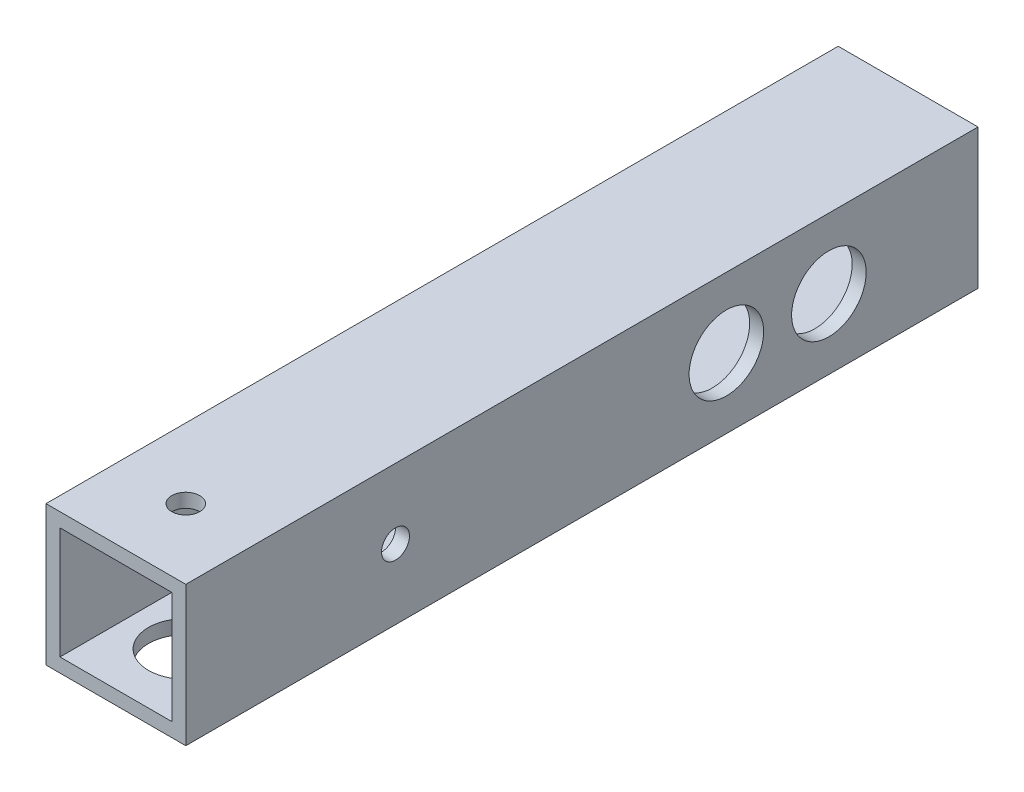
ISO-10303-21;
HEADER;
FILE_DESCRIPTION(('STEP AP214'),'2;1');
FILE_NAME('part.step','',(''),(''),'','','');
FILE_SCHEMA(('AUTOMOTIVE_DESIGN { 1 0 10303 214 1 1 1 1 }'));
ENDSEC;
DATA;
#1=APPLICATION_CONTEXT('core data for automotive mechanical design processes');
#2=APPLICATION_PROTOCOL_DEFINITION('international standard','automotive_design',2000,#1);
#3=PRODUCT_CONTEXT('',#1,'mechanical');
#4=PRODUCT('Part','Part','',(#3));
#5=PRODUCT_RELATED_PRODUCT_CATEGORY('part','',(#4));
#6=PRODUCT_DEFINITION_FORMATION('','',#4);
#7=PRODUCT_DEFINITION_CONTEXT('part definition',#1,'design');
#8=PRODUCT_DEFINITION('design','',#6,#7);
#9=PRODUCT_DEFINITION_SHAPE('','',#8);
#10=(LENGTH_UNIT() NAMED_UNIT(*) SI_UNIT(.MILLI.,.METRE.));
#11=(NAMED_UNIT(*) PLANE_ANGLE_UNIT() SI_UNIT($,.RADIAN.));
#12=(NAMED_UNIT(*) SI_UNIT($,.STERADIAN.) SOLID_ANGLE_UNIT());
#13=UNCERTAINTY_MEASURE_WITH_UNIT(LENGTH_MEASURE(1.E-05),#10,'distance_accuracy_value','');
#14=(GEOMETRIC_REPRESENTATION_CONTEXT(3) GLOBAL_UNCERTAINTY_ASSIGNED_CONTEXT((#13)) GLOBAL_UNIT_ASSIGNED_CONTEXT((#10,
#11,#12)) REPRESENTATION_CONTEXT('',''));
#15=CARTESIAN_POINT('',(0.,0.,0.));
#16=DIRECTION('',(0.,0.,1.));
#17=DIRECTION('',(1.,0.,0.));
#18=AXIS2_PLACEMENT_3D('',#15,#16,#17);
#19=CARTESIAN_POINT('',(0.,0.,85.));
#20=DIRECTION('',(0.,0.,1.));
#21=DIRECTION('',(1.,0.,0.));
#22=AXIS2_PLACEMENT_3D('',#19,#20,#21);
#23=PLANE('',#22);
#24=DIRECTION('',(0.,-1.,0.));
#25=VECTOR('',#24,1.);
#26=CARTESIAN_POINT('',(-7.01008414074451,7.73262608579252,85.));
#27=LINE('',#26,#25);
#28=CARTESIAN_POINT('',(-7.01008414074451,7.73262608579252,85.));
#29=VERTEX_POINT('',#28);
#30=CARTESIAN_POINT('',(-7.01008414074451,-7.26737391420748,85.));
#31=VERTEX_POINT('',#30);
#32=EDGE_CURVE('E137',#29,#31,#27,.T.);
#33=ORIENTED_EDGE('',*,*,#32,.T.);
#34=DIRECTION('',(1.,0.,0.));
#35=VECTOR('',#34,1.);
#36=CARTESIAN_POINT('',(-7.01008414074451,-7.26737391420748,85.));
#37=LINE('',#36,#35);
#38=CARTESIAN_POINT('',(7.98991585925548,-7.26737391420748,85.));
#39=VERTEX_POINT('',#38);
#40=EDGE_CURVE('E140',#31,#39,#37,.T.);
#41=ORIENTED_EDGE('',*,*,#40,.T.);
#42=DIRECTION('',(0.,1.,0.));
#43=VECTOR('',#42,1.);
#44=CARTESIAN_POINT('',(7.98991585925549,7.73262608579252,85.));
#45=LINE('',#44,#43);
#46=CARTESIAN_POINT('',(7.98991585925549,7.73262608579252,85.));
#47=VERTEX_POINT('',#46);
#48=EDGE_CURVE('E143',#39,#47,#45,.T.);
#49=ORIENTED_EDGE('',*,*,#48,.T.);
#50=DIRECTION('',(-1.,0.,0.));
#51=VECTOR('',#50,1.);
#52=CARTESIAN_POINT('',(-7.01008414074451,7.73262608579252,85.));
#53=LINE('',#52,#51);
#54=EDGE_CURVE('E145',#47,#29,#53,.T.);
#55=ORIENTED_EDGE('',*,*,#54,.T.);
#56=EDGE_LOOP('',(#33,#41,#49,#55));
#57=FACE_BOUND('',#56,.T.);
#58=DIRECTION('',(1.,0.,0.));
#59=VECTOR('',#58,1.);
#60=CARTESIAN_POINT('',(-5.51008414074451,-5.76737391420748,85.));
#61=LINE('',#60,#59);
#62=CARTESIAN_POINT('',(-5.51008414074451,-5.76737391420748,85.));
#63=VERTEX_POINT('',#62);
#64=CARTESIAN_POINT('',(6.48991585925549,-5.76737391420748,85.));
#65=VERTEX_POINT('',#64);
#66=EDGE_CURVE('E107',#63,#65,#61,.T.);
#67=ORIENTED_EDGE('',*,*,#66,.F.);
#68=DIRECTION('',(0.,-1.,0.));
#69=VECTOR('',#68,1.);
#70=CARTESIAN_POINT('',(-5.51008414074451,6.23262608579252,85.));
#71=LINE('',#70,#69);
#72=CARTESIAN_POINT('',(-5.51008414074451,6.23262608579252,85.));
#73=VERTEX_POINT('',#72);
#74=EDGE_CURVE('E99',#73,#63,#71,.T.);
#75=ORIENTED_EDGE('',*,*,#74,.F.);
#76=DIRECTION('',(-1.,0.,0.));
#77=VECTOR('',#76,1.);
#78=CARTESIAN_POINT('',(-5.51008414074451,6.23262608579252,85.));
#79=LINE('',#78,#77);
#80=CARTESIAN_POINT('',(6.48991585925549,6.23262608579252,85.));
#81=VERTEX_POINT('',#80);
#82=EDGE_CURVE('E121',#81,#73,#79,.T.);
#83=ORIENTED_EDGE('',*,*,#82,.F.);
#84=DIRECTION('',(0.,1.,0.));
#85=VECTOR('',#84,1.);
#86=CARTESIAN_POINT('',(6.48991585925549,6.23262608579252,85.));
#87=LINE('',#86,#85);
#88=EDGE_CURVE('E119',#65,#81,#87,.T.);
#89=ORIENTED_EDGE('',*,*,#88,.F.);
#90=EDGE_LOOP('',(#67,#75,#83,#89));
#91=FACE_BOUND('',#90,.T.);
#92=ADVANCED_FACE('F32',(#57,#91),#23,.T.);
#93=CARTESIAN_POINT('',(0.,0.,0.));
#94=DIRECTION('',(0.,0.,1.));
#95=DIRECTION('',(1.,0.,0.));
#96=AXIS2_PLACEMENT_3D('',#93,#94,#95);
#97=PLANE('',#96);
#98=DIRECTION('',(0.,-1.,0.));
#99=VECTOR('',#98,1.);
#100=CARTESIAN_POINT('',(-7.01008414074451,7.73262608579252,0.));
#101=LINE('',#100,#99);
#102=CARTESIAN_POINT('',(-7.01008414074451,7.73262608579252,0.));
#103=VERTEX_POINT('',#102);
#104=CARTESIAN_POINT('',(-7.01008414074451,-7.26737391420748,0.));
#105=VERTEX_POINT('',#104);
#106=EDGE_CURVE('E115',#103,#105,#101,.T.);
#107=ORIENTED_EDGE('',*,*,#106,.F.);
#108=DIRECTION('',(-1.,0.,0.));
#109=VECTOR('',#108,1.);
#110=CARTESIAN_POINT('',(-7.01008414074451,7.73262608579252,0.));
#111=LINE('',#110,#109);
#112=CARTESIAN_POINT('',(7.98991585925549,7.73262608579252,0.));
#113=VERTEX_POINT('',#112);
#114=EDGE_CURVE('E141',#113,#103,#111,.T.);
#115=ORIENTED_EDGE('',*,*,#114,.F.);
#116=DIRECTION('',(0.,1.,0.));
#117=VECTOR('',#116,1.);
#118=CARTESIAN_POINT('',(7.98991585925549,7.73262608579252,0.));
#119=LINE('',#118,#117);
#120=CARTESIAN_POINT('',(7.98991585925548,-7.26737391420748,0.));
#121=VERTEX_POINT('',#120);
#122=EDGE_CURVE('E152',#121,#113,#119,.T.);
#123=ORIENTED_EDGE('',*,*,#122,.F.);
#124=DIRECTION('',(1.,0.,0.));
#125=VECTOR('',#124,1.);
#126=CARTESIAN_POINT('',(-7.01008414074451,-7.26737391420748,0.));
#127=LINE('',#126,#125);
#128=EDGE_CURVE('E150',#105,#121,#127,.T.);
#129=ORIENTED_EDGE('',*,*,#128,.F.);
#130=EDGE_LOOP('',(#107,#115,#123,#129));
#131=FACE_BOUND('',#130,.T.);
#132=DIRECTION('',(0.,-1.,0.));
#133=VECTOR('',#132,1.);
#134=CARTESIAN_POINT('',(-5.51008414074451,6.23262608579252,0.));
#135=LINE('',#134,#133);
#136=CARTESIAN_POINT('',(-5.51008414074451,6.23262608579252,0.));
#137=VERTEX_POINT('',#136);
#138=CARTESIAN_POINT('',(-5.51008414074451,-5.76737391420748,0.));
#139=VERTEX_POINT('',#138);
#140=EDGE_CURVE('E57',#137,#139,#135,.T.);
#141=ORIENTED_EDGE('',*,*,#140,.T.);
#142=DIRECTION('',(1.,0.,0.));
#143=VECTOR('',#142,1.);
#144=CARTESIAN_POINT('',(-5.51008414074451,-5.76737391420748,0.));
#145=LINE('',#144,#143);
#146=CARTESIAN_POINT('',(6.48991585925549,-5.76737391420748,0.));
#147=VERTEX_POINT('',#146);
#148=EDGE_CURVE('E114',#139,#147,#145,.T.);
#149=ORIENTED_EDGE('',*,*,#148,.T.);
#150=DIRECTION('',(0.,1.,0.));
#151=VECTOR('',#150,1.);
#152=CARTESIAN_POINT('',(6.48991585925549,6.23262608579252,0.));
#153=LINE('',#152,#151);
#154=CARTESIAN_POINT('',(6.48991585925549,6.23262608579252,0.));
#155=VERTEX_POINT('',#154);
#156=EDGE_CURVE('E129',#147,#155,#153,.T.);
#157=ORIENTED_EDGE('',*,*,#156,.T.);
#158=DIRECTION('',(-1.,0.,0.));
#159=VECTOR('',#158,1.);
#160=CARTESIAN_POINT('',(-5.51008414074451,6.23262608579252,0.));
#161=LINE('',#160,#159);
#162=EDGE_CURVE('E108',#155,#137,#161,.T.);
#163=ORIENTED_EDGE('',*,*,#162,.T.);
#164=EDGE_LOOP('',(#141,#149,#157,#163));
#165=FACE_BOUND('',#164,.T.);
#166=ADVANCED_FACE('F233',(#131,#165),#97,.F.);
#167=CARTESIAN_POINT('',(-7.01008414074451,7.73262608579252,85.));
#168=DIRECTION('',(1.,0.,0.));
#169=DIRECTION('',(0.,1.,0.));
#170=AXIS2_PLACEMENT_3D('',#167,#168,#169);
#171=PLANE('',#170);
#172=CARTESIAN_POINT('',(-7.01008414074451,0.232626085792518,27.));
#173=DIRECTION('',(-1.,0.,0.));
#174=DIRECTION('',(0.,-1.,0.));
#175=AXIS2_PLACEMENT_3D('',#172,#173,#174);
#176=CIRCLE('',#175,1.5);
#177=CARTESIAN_POINT('',(-7.01008414074451,-1.26737391420748,27.));
#178=VERTEX_POINT('',#177);
#179=EDGE_CURVE('E187',#178,#178,#176,.T.);
#180=ORIENTED_EDGE('',*,*,#179,.F.);
#181=EDGE_LOOP('',(#180));
#182=FACE_BOUND('',#181,.T.);
#183=CARTESIAN_POINT('',(-7.01008414074451,0.232626085792519,5.));
#184=DIRECTION('',(-1.,0.,0.));
#185=DIRECTION('',(0.,-1.,0.));
#186=AXIS2_PLACEMENT_3D('',#183,#184,#185);
#187=CIRCLE('',#186,1.5);
#188=CARTESIAN_POINT('',(-7.01008414074451,-1.26737391420748,5.));
#189=VERTEX_POINT('',#188);
#190=EDGE_CURVE('E184',#189,#189,#187,.T.);
#191=ORIENTED_EDGE('',*,*,#190,.F.);
#192=EDGE_LOOP('',(#191));
#193=FACE_BOUND('',#192,.T.);
#194=CARTESIAN_POINT('',(-7.01008414074451,0.232626085792518,16.));
#195=DIRECTION('',(-1.,0.,0.));
#196=DIRECTION('',(0.,-1.,0.));
#197=AXIS2_PLACEMENT_3D('',#194,#195,#196);
#198=CIRCLE('',#197,3.);
#199=CARTESIAN_POINT('',(-7.01008414074451,-2.76737391420748,16.));
#200=VERTEX_POINT('',#199);
#201=EDGE_CURVE('E180',#200,#200,#198,.T.);
#202=ORIENTED_EDGE('',*,*,#201,.F.);
#203=EDGE_LOOP('',(#202));
#204=FACE_BOUND('',#203,.T.);
#205=CARTESIAN_POINT('',(-7.01008414074451,0.232626085792516,62.5));
#206=DIRECTION('',(-1.,0.,0.));
#207=DIRECTION('',(0.,-1.,0.));
#208=AXIS2_PLACEMENT_3D('',#205,#206,#207);
#209=CIRCLE('',#208,4.00000000000001);
#210=CARTESIAN_POINT('',(-7.01008414074451,-3.76737391420749,62.5));
#211=VERTEX_POINT('',#210);
#212=EDGE_CURVE('E176',#211,#211,#209,.T.);
#213=ORIENTED_EDGE('',*,*,#212,.F.);
#214=EDGE_LOOP('',(#213));
#215=FACE_BOUND('',#214,.T.);
#216=ORIENTED_EDGE('',*,*,#106,.T.);
#217=DIRECTION('',(0.,0.,-1.));
#218=VECTOR('',#217,1.);
#219=CARTESIAN_POINT('',(-7.01008414074451,-7.26737391420748,85.));
#220=LINE('',#219,#218);
#221=EDGE_CURVE('E11',#31,#105,#220,.T.);
#222=ORIENTED_EDGE('',*,*,#221,.F.);
#223=ORIENTED_EDGE('',*,*,#32,.F.);
#224=DIRECTION('',(0.,0.,-1.));
#225=VECTOR('',#224,1.);
#226=CARTESIAN_POINT('',(-7.01008414074451,7.73262608579252,85.));
#227=LINE('',#226,#225);
#228=EDGE_CURVE('E147',#29,#103,#227,.T.);
#229=ORIENTED_EDGE('',*,*,#228,.T.);
#230=EDGE_LOOP('',(#216,#222,#223,#229));
#231=FACE_BOUND('',#230,.T.);
#232=ADVANCED_FACE('F34',(#182,#193,#204,#215,#231),#171,.F.);
#233=CARTESIAN_POINT('',(-7.01008414074451,-7.26737391420748,85.));
#234=DIRECTION('',(0.,1.,0.));
#235=DIRECTION('',(0.,0.,1.));
#236=AXIS2_PLACEMENT_3D('',#233,#234,#235);
#237=PLANE('',#236);
#238=CARTESIAN_POINT('',(0.489915859255487,-7.26737391420748,77.5));
#239=DIRECTION('',(0.,-1.,0.));
#240=DIRECTION('',(0.,0.,-1.));
#241=AXIS2_PLACEMENT_3D('',#238,#239,#240);
#242=CIRCLE('',#241,4.);
#243=CARTESIAN_POINT('',(0.489915859255487,-7.26737391420748,73.5));
#244=VERTEX_POINT('',#243);
#245=EDGE_CURVE('E172',#244,#244,#242,.T.);
#246=ORIENTED_EDGE('',*,*,#245,.F.);
#247=EDGE_LOOP('',(#246));
#248=FACE_BOUND('',#247,.T.);
#249=ORIENTED_EDGE('',*,*,#128,.T.);
#250=DIRECTION('',(0.,0.,-1.));
#251=VECTOR('',#250,1.);
#252=CARTESIAN_POINT('',(7.98991585925548,-7.26737391420748,85.));
#253=LINE('',#252,#251);
#254=EDGE_CURVE('E41',#39,#121,#253,.T.);
#255=ORIENTED_EDGE('',*,*,#254,.F.);
#256=ORIENTED_EDGE('',*,*,#40,.F.);
#257=ORIENTED_EDGE('',*,*,#221,.T.);
#258=EDGE_LOOP('',(#249,#255,#256,#257));
#259=FACE_BOUND('',#258,.T.);
#260=ADVANCED_FACE('F237',(#248,#259),#237,.F.);
#261=CARTESIAN_POINT('',(7.98991585925549,7.73262608579252,85.));
#262=DIRECTION('',(-1.,0.,0.));
#263=DIRECTION('',(0.,-1.,0.));
#264=AXIS2_PLACEMENT_3D('',#261,#262,#263);
#265=PLANE('',#264);
#266=CARTESIAN_POINT('',(7.98991585925548,0.232626085792515,16.));
#267=DIRECTION('',(1.,0.,0.));
#268=DIRECTION('',(0.,1.,0.));
#269=AXIS2_PLACEMENT_3D('',#266,#267,#268);
#270=CIRCLE('',#269,4.);
#271=CARTESIAN_POINT('',(7.98991585925549,4.23262608579252,16.));
#272=VERTEX_POINT('',#271);
#273=EDGE_CURVE('E190',#272,#272,#270,.T.);
#274=ORIENTED_EDGE('',*,*,#273,.F.);
#275=EDGE_LOOP('',(#274));
#276=FACE_BOUND('',#275,.T.);
#277=CARTESIAN_POINT('',(7.98991585925548,0.232626085792515,27.));
#278=DIRECTION('',(1.,0.,0.));
#279=DIRECTION('',(0.,1.,0.));
#280=AXIS2_PLACEMENT_3D('',#277,#278,#279);
#281=CIRCLE('',#280,4.);
#282=CARTESIAN_POINT('',(7.98991585925549,4.23262608579251,27.));
#283=VERTEX_POINT('',#282);
#284=EDGE_CURVE('E195',#283,#283,#281,.T.);
#285=ORIENTED_EDGE('',*,*,#284,.F.);
#286=EDGE_LOOP('',(#285));
#287=FACE_BOUND('',#286,.T.);
#288=CARTESIAN_POINT('',(7.98991585925548,0.232626085792518,62.5));
#289=DIRECTION('',(1.,0.,0.));
#290=DIRECTION('',(0.,1.,0.));
#291=AXIS2_PLACEMENT_3D('',#288,#289,#290);
#292=CIRCLE('',#291,1.5);
#293=CARTESIAN_POINT('',(7.98991585925548,1.73262608579252,62.5));
#294=VERTEX_POINT('',#293);
#295=EDGE_CURVE('E168',#294,#294,#292,.T.);
#296=ORIENTED_EDGE('',*,*,#295,.F.);
#297=EDGE_LOOP('',(#296));
#298=FACE_BOUND('',#297,.T.);
#299=ORIENTED_EDGE('',*,*,#122,.T.);
#300=DIRECTION('',(0.,0.,-1.));
#301=VECTOR('',#300,1.);
#302=CARTESIAN_POINT('',(7.98991585925549,7.73262608579252,85.));
#303=LINE('',#302,#301);
#304=EDGE_CURVE('E157',#47,#113,#303,.T.);
#305=ORIENTED_EDGE('',*,*,#304,.F.);
#306=ORIENTED_EDGE('',*,*,#48,.F.);
#307=ORIENTED_EDGE('',*,*,#254,.T.);
#308=EDGE_LOOP('',(#299,#305,#306,#307));
#309=FACE_BOUND('',#308,.T.);
#310=ADVANCED_FACE('F221',(#276,#287,#298,#309),#265,.F.);
#311=CARTESIAN_POINT('',(-7.01008414074451,7.73262608579252,85.));
#312=DIRECTION('',(0.,-1.,0.));
#313=DIRECTION('',(0.,0.,-1.));
#314=AXIS2_PLACEMENT_3D('',#311,#312,#313);
#315=PLANE('',#314);
#316=CARTESIAN_POINT('',(0.489915859255487,7.73262608579252,77.5));
#317=DIRECTION('',(0.,1.,0.));
#318=DIRECTION('',(0.,0.,1.));
#319=AXIS2_PLACEMENT_3D('',#316,#317,#318);
#320=CIRCLE('',#319,1.5);
#321=CARTESIAN_POINT('',(0.489915859255487,7.73262608579252,79.));
#322=VERTEX_POINT('',#321);
#323=EDGE_CURVE('E164',#322,#322,#320,.T.);
#324=ORIENTED_EDGE('',*,*,#323,.F.);
#325=EDGE_LOOP('',(#324));
#326=FACE_BOUND('',#325,.T.);
#327=ORIENTED_EDGE('',*,*,#114,.T.);
#328=ORIENTED_EDGE('',*,*,#228,.F.);
#329=ORIENTED_EDGE('',*,*,#54,.F.);
#330=ORIENTED_EDGE('',*,*,#304,.T.);
#331=EDGE_LOOP('',(#327,#328,#329,#330));
#332=FACE_BOUND('',#331,.T.);
#333=ADVANCED_FACE('F218',(#326,#332),#315,.F.);
#334=CARTESIAN_POINT('',(-5.51008414074451,6.23262608579252,85.));
#335=DIRECTION('',(1.,0.,0.));
#336=DIRECTION('',(0.,1.,0.));
#337=AXIS2_PLACEMENT_3D('',#334,#335,#336);
#338=PLANE('',#337);
#339=CARTESIAN_POINT('',(-5.51008414074451,0.232626085792519,27.));
#340=DIRECTION('',(1.,0.,0.));
#341=DIRECTION('',(0.,1.,0.));
#342=AXIS2_PLACEMENT_3D('',#339,#340,#341);
#343=CIRCLE('',#342,1.5);
#344=CARTESIAN_POINT('',(-5.51008414074451,1.73262608579252,27.));
#345=VERTEX_POINT('',#344);
#346=EDGE_CURVE('E185',#345,#345,#343,.T.);
#347=ORIENTED_EDGE('',*,*,#346,.F.);
#348=EDGE_LOOP('',(#347));
#349=FACE_BOUND('',#348,.T.);
#350=CARTESIAN_POINT('',(-5.51008414074451,0.232626085792519,5.));
#351=DIRECTION('',(1.,0.,0.));
#352=DIRECTION('',(0.,1.,0.));
#353=AXIS2_PLACEMENT_3D('',#350,#351,#352);
#354=CIRCLE('',#353,1.5);
#355=CARTESIAN_POINT('',(-5.51008414074451,1.73262608579252,5.));
#356=VERTEX_POINT('',#355);
#357=EDGE_CURVE('E181',#356,#356,#354,.T.);
#358=ORIENTED_EDGE('',*,*,#357,.F.);
#359=EDGE_LOOP('',(#358));
#360=FACE_BOUND('',#359,.T.);
#361=CARTESIAN_POINT('',(-5.51008414074451,0.232626085792519,16.));
#362=DIRECTION('',(1.,0.,0.));
#363=DIRECTION('',(0.,1.,0.));
#364=AXIS2_PLACEMENT_3D('',#361,#362,#363);
#365=CIRCLE('',#364,3.);
#366=CARTESIAN_POINT('',(-5.51008414074451,3.23262608579252,16.));
#367=VERTEX_POINT('',#366);
#368=EDGE_CURVE('E177',#367,#367,#365,.T.);
#369=ORIENTED_EDGE('',*,*,#368,.F.);
#370=EDGE_LOOP('',(#369));
#371=FACE_BOUND('',#370,.T.);
#372=CARTESIAN_POINT('',(-5.51008414074451,0.232626085792516,62.5));
#373=DIRECTION('',(1.,0.,0.));
#374=DIRECTION('',(0.,1.,0.));
#375=AXIS2_PLACEMENT_3D('',#372,#373,#374);
#376=CIRCLE('',#375,4.00000000000001);
#377=CARTESIAN_POINT('',(-5.51008414074451,4.23262608579252,62.5));
#378=VERTEX_POINT('',#377);
#379=EDGE_CURVE('E173',#378,#378,#376,.T.);
#380=ORIENTED_EDGE('',*,*,#379,.F.);
#381=EDGE_LOOP('',(#380));
#382=FACE_BOUND('',#381,.T.);
#383=ORIENTED_EDGE('',*,*,#140,.F.);
#384=DIRECTION('',(0.,0.,-1.));
#385=VECTOR('',#384,1.);
#386=CARTESIAN_POINT('',(-5.51008414074451,6.23262608579252,85.));
#387=LINE('',#386,#385);
#388=EDGE_CURVE('E103',#73,#137,#387,.T.);
#389=ORIENTED_EDGE('',*,*,#388,.F.);
#390=ORIENTED_EDGE('',*,*,#74,.T.);
#391=DIRECTION('',(0.,0.,-1.));
#392=VECTOR('',#391,1.);
#393=CARTESIAN_POINT('',(-5.51008414074451,-5.76737391420748,85.));
#394=LINE('',#393,#392);
#395=EDGE_CURVE('E102',#63,#139,#394,.T.);
#396=ORIENTED_EDGE('',*,*,#395,.T.);
#397=EDGE_LOOP('',(#383,#389,#390,#396));
#398=FACE_BOUND('',#397,.T.);
#399=ADVANCED_FACE('F101',(#349,#360,#371,#382,#398),#338,.T.);
#400=CARTESIAN_POINT('',(-5.51008414074451,-5.76737391420748,85.));
#401=DIRECTION('',(0.,1.,0.));
#402=DIRECTION('',(0.,0.,1.));
#403=AXIS2_PLACEMENT_3D('',#400,#401,#402);
#404=PLANE('',#403);
#405=CARTESIAN_POINT('',(0.489915859255487,-5.76737391420748,77.5));
#406=DIRECTION('',(0.,1.,0.));
#407=DIRECTION('',(0.,0.,1.));
#408=AXIS2_PLACEMENT_3D('',#405,#406,#407);
#409=CIRCLE('',#408,4.);
#410=CARTESIAN_POINT('',(0.489915859255487,-5.76737391420748,81.5));
#411=VERTEX_POINT('',#410);
#412=EDGE_CURVE('E169',#411,#411,#409,.T.);
#413=ORIENTED_EDGE('',*,*,#412,.F.);
#414=EDGE_LOOP('',(#413));
#415=FACE_BOUND('',#414,.T.);
#416=ORIENTED_EDGE('',*,*,#148,.F.);
#417=ORIENTED_EDGE('',*,*,#395,.F.);
#418=ORIENTED_EDGE('',*,*,#66,.T.);
#419=DIRECTION('',(0.,0.,-1.));
#420=VECTOR('',#419,1.);
#421=CARTESIAN_POINT('',(6.48991585925549,-5.76737391420748,85.));
#422=LINE('',#421,#420);
#423=EDGE_CURVE('E116',#65,#147,#422,.T.);
#424=ORIENTED_EDGE('',*,*,#423,.T.);
#425=EDGE_LOOP('',(#416,#417,#418,#424));
#426=FACE_BOUND('',#425,.T.);
#427=ADVANCED_FACE('F111',(#415,#426),#404,.T.);
#428=CARTESIAN_POINT('',(6.48991585925549,6.23262608579252,85.));
#429=DIRECTION('',(-1.,0.,0.));
#430=DIRECTION('',(0.,-1.,0.));
#431=AXIS2_PLACEMENT_3D('',#428,#429,#430);
#432=PLANE('',#431);
#433=CARTESIAN_POINT('',(6.48991585925549,0.232626085792515,16.));
#434=DIRECTION('',(-1.,0.,0.));
#435=DIRECTION('',(0.,-1.,0.));
#436=AXIS2_PLACEMENT_3D('',#433,#434,#435);
#437=CIRCLE('',#436,4.);
#438=CARTESIAN_POINT('',(6.48991585925549,-3.76737391420749,16.));
#439=VERTEX_POINT('',#438);
#440=EDGE_CURVE('E36',#439,#439,#437,.T.);
#441=ORIENTED_EDGE('',*,*,#440,.F.);
#442=EDGE_LOOP('',(#441));
#443=FACE_BOUND('',#442,.T.);
#444=CARTESIAN_POINT('',(6.48991585925549,0.232626085792515,27.));
#445=DIRECTION('',(-1.,0.,0.));
#446=DIRECTION('',(0.,-1.,0.));
#447=AXIS2_PLACEMENT_3D('',#444,#445,#446);
#448=CIRCLE('',#447,4.);
#449=CARTESIAN_POINT('',(6.48991585925549,-3.76737391420748,27.));
#450=VERTEX_POINT('',#449);
#451=EDGE_CURVE('E188',#450,#450,#448,.T.);
#452=ORIENTED_EDGE('',*,*,#451,.F.);
#453=EDGE_LOOP('',(#452));
#454=FACE_BOUND('',#453,.T.);
#455=CARTESIAN_POINT('',(6.48991585925549,0.232626085792519,62.5));
#456=DIRECTION('',(-1.,0.,0.));
#457=DIRECTION('',(0.,-1.,0.));
#458=AXIS2_PLACEMENT_3D('',#455,#456,#457);
#459=CIRCLE('',#458,1.5);
#460=CARTESIAN_POINT('',(6.48991585925549,-1.26737391420748,62.5));
#461=VERTEX_POINT('',#460);
#462=EDGE_CURVE('E165',#461,#461,#459,.T.);
#463=ORIENTED_EDGE('',*,*,#462,.F.);
#464=EDGE_LOOP('',(#463));
#465=FACE_BOUND('',#464,.T.);
#466=ORIENTED_EDGE('',*,*,#156,.F.);
#467=ORIENTED_EDGE('',*,*,#423,.F.);
#468=ORIENTED_EDGE('',*,*,#88,.T.);
#469=DIRECTION('',(0.,0.,-1.));
#470=VECTOR('',#469,1.);
#471=CARTESIAN_POINT('',(6.48991585925549,6.23262608579252,85.));
#472=LINE('',#471,#470);
#473=EDGE_CURVE('E49',#81,#155,#472,.T.);
#474=ORIENTED_EDGE('',*,*,#473,.T.);
#475=EDGE_LOOP('',(#466,#467,#468,#474));
#476=FACE_BOUND('',#475,.T.);
#477=ADVANCED_FACE('F261',(#443,#454,#465,#476),#432,.T.);
#478=CARTESIAN_POINT('',(-5.51008414074451,6.23262608579252,85.));
#479=DIRECTION('',(0.,-1.,0.));
#480=DIRECTION('',(0.,0.,-1.));
#481=AXIS2_PLACEMENT_3D('',#478,#479,#480);
#482=PLANE('',#481);
#483=CARTESIAN_POINT('',(0.489915859255487,6.23262608579252,77.5));
#484=DIRECTION('',(0.,-1.,0.));
#485=DIRECTION('',(0.,0.,-1.));
#486=AXIS2_PLACEMENT_3D('',#483,#484,#485);
#487=CIRCLE('',#486,1.5);
#488=CARTESIAN_POINT('',(0.489915859255487,6.23262608579252,76.));
#489=VERTEX_POINT('',#488);
#490=EDGE_CURVE('E127',#489,#489,#487,.T.);
#491=ORIENTED_EDGE('',*,*,#490,.F.);
#492=EDGE_LOOP('',(#491));
#493=FACE_BOUND('',#492,.T.);
#494=ORIENTED_EDGE('',*,*,#162,.F.);
#495=ORIENTED_EDGE('',*,*,#473,.F.);
#496=ORIENTED_EDGE('',*,*,#82,.T.);
#497=ORIENTED_EDGE('',*,*,#388,.T.);
#498=EDGE_LOOP('',(#494,#495,#496,#497));
#499=FACE_BOUND('',#498,.T.);
#500=ADVANCED_FACE('F265',(#493,#499),#482,.T.);
#501=CARTESIAN_POINT('',(0.489915859255487,-2.26737391420748,77.5));
#502=DIRECTION('',(0.,1.,0.));
#503=DIRECTION('',(0.,0.,1.));
#504=AXIS2_PLACEMENT_3D('',#501,#502,#503);
#505=CYLINDRICAL_SURFACE('',#504,1.5);
#506=ORIENTED_EDGE('',*,*,#490,.T.);
#507=EDGE_LOOP('',(#506));
#508=FACE_BOUND('',#507,.T.);
#509=ORIENTED_EDGE('',*,*,#323,.T.);
#510=EDGE_LOOP('',(#509));
#511=FACE_BOUND('',#510,.T.);
#512=ADVANCED_FACE('F216',(#508,#511),#505,.F.);
#513=CARTESIAN_POINT('',(-2.01008414074452,0.232626085792521,62.5));
#514=DIRECTION('',(1.,0.,0.));
#515=DIRECTION('',(0.,1.,0.));
#516=AXIS2_PLACEMENT_3D('',#513,#514,#515);
#517=CYLINDRICAL_SURFACE('',#516,1.5);
#518=ORIENTED_EDGE('',*,*,#462,.T.);
#519=EDGE_LOOP('',(#518));
#520=FACE_BOUND('',#519,.T.);
#521=ORIENTED_EDGE('',*,*,#295,.T.);
#522=EDGE_LOOP('',(#521));
#523=FACE_BOUND('',#522,.T.);
#524=ADVANCED_FACE('F272',(#520,#523),#517,.F.);
#525=CARTESIAN_POINT('',(0.489915859255487,2.73262608579252,77.5));
#526=DIRECTION('',(0.,-1.,0.));
#527=DIRECTION('',(0.,0.,-1.));
#528=AXIS2_PLACEMENT_3D('',#525,#526,#527);
#529=CYLINDRICAL_SURFACE('',#528,4.);
#530=ORIENTED_EDGE('',*,*,#412,.T.);
#531=EDGE_LOOP('',(#530));
#532=FACE_BOUND('',#531,.T.);
#533=ORIENTED_EDGE('',*,*,#245,.T.);
#534=EDGE_LOOP('',(#533));
#535=FACE_BOUND('',#534,.T.);
#536=ADVANCED_FACE('F276',(#532,#535),#529,.F.);
#537=CARTESIAN_POINT('',(2.98991585925549,0.232626085792518,62.5));
#538=DIRECTION('',(-1.,0.,0.));
#539=DIRECTION('',(0.,-1.,0.));
#540=AXIS2_PLACEMENT_3D('',#537,#538,#539);
#541=CYLINDRICAL_SURFACE('',#540,4.00000000000001);
#542=ORIENTED_EDGE('',*,*,#379,.T.);
#543=EDGE_LOOP('',(#542));
#544=FACE_BOUND('',#543,.T.);
#545=ORIENTED_EDGE('',*,*,#212,.T.);
#546=EDGE_LOOP('',(#545));
#547=FACE_BOUND('',#546,.T.);
#548=ADVANCED_FACE('F280',(#544,#547),#541,.F.);
#549=CARTESIAN_POINT('',(2.98991585925549,0.23262608579252,16.));
#550=DIRECTION('',(-1.,0.,0.));
#551=DIRECTION('',(0.,-1.,0.));
#552=AXIS2_PLACEMENT_3D('',#549,#550,#551);
#553=CYLINDRICAL_SURFACE('',#552,3.);
#554=ORIENTED_EDGE('',*,*,#368,.T.);
#555=EDGE_LOOP('',(#554));
#556=FACE_BOUND('',#555,.T.);
#557=ORIENTED_EDGE('',*,*,#201,.T.);
#558=EDGE_LOOP('',(#557));
#559=FACE_BOUND('',#558,.T.);
#560=ADVANCED_FACE('F284',(#556,#559),#553,.F.);
#561=CARTESIAN_POINT('',(2.98991585925549,0.232626085792521,5.));
#562=DIRECTION('',(-1.,0.,0.));
#563=DIRECTION('',(0.,-1.,0.));
#564=AXIS2_PLACEMENT_3D('',#561,#562,#563);
#565=CYLINDRICAL_SURFACE('',#564,1.5);
#566=ORIENTED_EDGE('',*,*,#357,.T.);
#567=EDGE_LOOP('',(#566));
#568=FACE_BOUND('',#567,.T.);
#569=ORIENTED_EDGE('',*,*,#190,.T.);
#570=EDGE_LOOP('',(#569));
#571=FACE_BOUND('',#570,.T.);
#572=ADVANCED_FACE('F288',(#568,#571),#565,.F.);
#573=CARTESIAN_POINT('',(2.98991585925549,0.23262608579252,27.));
#574=DIRECTION('',(-1.,0.,0.));
#575=DIRECTION('',(0.,-1.,0.));
#576=AXIS2_PLACEMENT_3D('',#573,#574,#575);
#577=CYLINDRICAL_SURFACE('',#576,1.5);
#578=ORIENTED_EDGE('',*,*,#346,.T.);
#579=EDGE_LOOP('',(#578));
#580=FACE_BOUND('',#579,.T.);
#581=ORIENTED_EDGE('',*,*,#179,.T.);
#582=EDGE_LOOP('',(#581));
#583=FACE_BOUND('',#582,.T.);
#584=ADVANCED_FACE('F292',(#580,#583),#577,.F.);
#585=CARTESIAN_POINT('',(-2.01008414074452,0.232626085792517,27.));
#586=DIRECTION('',(1.,0.,0.));
#587=DIRECTION('',(0.,1.,0.));
#588=AXIS2_PLACEMENT_3D('',#585,#586,#587);
#589=CYLINDRICAL_SURFACE('',#588,4.);
#590=ORIENTED_EDGE('',*,*,#451,.T.);
#591=EDGE_LOOP('',(#590));
#592=FACE_BOUND('',#591,.T.);
#593=ORIENTED_EDGE('',*,*,#284,.T.);
#594=EDGE_LOOP('',(#593));
#595=FACE_BOUND('',#594,.T.);
#596=ADVANCED_FACE('F296',(#592,#595),#589,.F.);
#597=CARTESIAN_POINT('',(-2.01008414074452,0.232626085792517,16.));
#598=DIRECTION('',(1.,0.,0.));
#599=DIRECTION('',(0.,1.,0.));
#600=AXIS2_PLACEMENT_3D('',#597,#598,#599);
#601=CYLINDRICAL_SURFACE('',#600,4.);
#602=ORIENTED_EDGE('',*,*,#440,.T.);
#603=EDGE_LOOP('',(#602));
#604=FACE_BOUND('',#603,.T.);
#605=ORIENTED_EDGE('',*,*,#273,.T.);
#606=EDGE_LOOP('',(#605));
#607=FACE_BOUND('',#606,.T.);
#608=ADVANCED_FACE('F300',(#604,#607),#601,.F.);
#609=CLOSED_SHELL('',(#92,#166,#232,#260,#310,#333,#399,#427,#477,#500,#512,#524,#536,#548,#560,
#572,#584,#596,#608));
#610=MANIFOLD_SOLID_BREP('B2',#609);
#611=ADVANCED_BREP_SHAPE_REPRESENTATION('',(#18,#610),#14);
#612=SHAPE_DEFINITION_REPRESENTATION(#9,#611);
ENDSEC;
END-ISO-10303-21;
